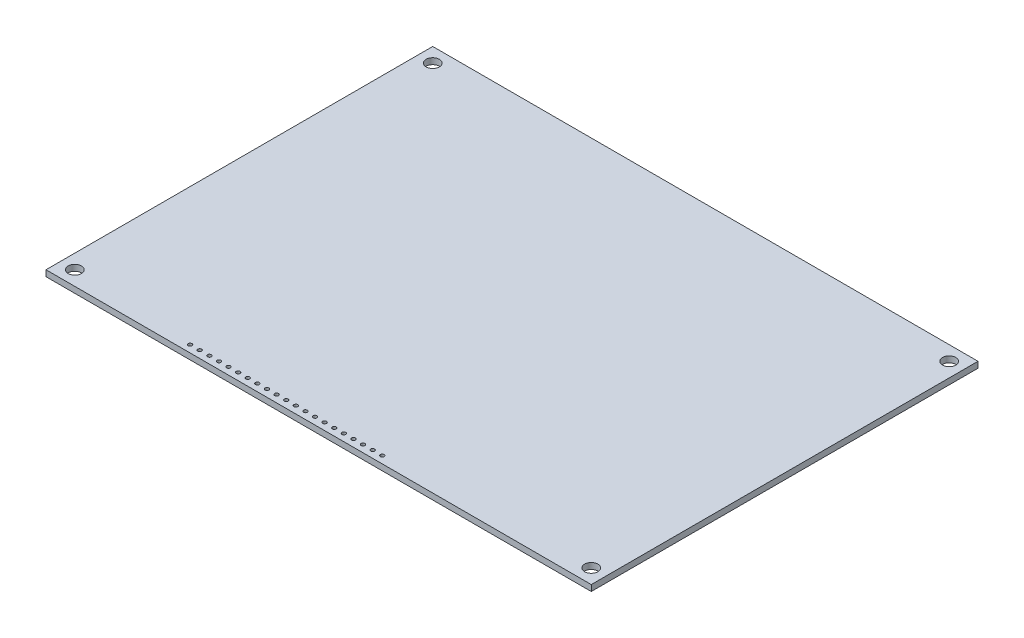
ISO-10303-21;
HEADER;
FILE_DESCRIPTION(('STEP AP214'),'2;1');
FILE_NAME('part.step','',(''),(''),'','','');
FILE_SCHEMA(('AUTOMOTIVE_DESIGN { 1 0 10303 214 1 1 1 1 }'));
ENDSEC;
DATA;
#1=APPLICATION_CONTEXT('core data for automotive mechanical design processes');
#2=APPLICATION_PROTOCOL_DEFINITION('international standard','automotive_design',2000,#1);
#3=PRODUCT_CONTEXT('',#1,'mechanical');
#4=PRODUCT('Part','Part','',(#3));
#5=PRODUCT_RELATED_PRODUCT_CATEGORY('part','',(#4));
#6=PRODUCT_DEFINITION_FORMATION('','',#4);
#7=PRODUCT_DEFINITION_CONTEXT('part definition',#1,'design');
#8=PRODUCT_DEFINITION('design','',#6,#7);
#9=PRODUCT_DEFINITION_SHAPE('','',#8);
#10=(LENGTH_UNIT() NAMED_UNIT(*) SI_UNIT(.MILLI.,.METRE.));
#11=(NAMED_UNIT(*) PLANE_ANGLE_UNIT() SI_UNIT($,.RADIAN.));
#12=(NAMED_UNIT(*) SI_UNIT($,.STERADIAN.) SOLID_ANGLE_UNIT());
#13=UNCERTAINTY_MEASURE_WITH_UNIT(LENGTH_MEASURE(1.E-05),#10,'distance_accuracy_value','');
#14=(GEOMETRIC_REPRESENTATION_CONTEXT(3) GLOBAL_UNCERTAINTY_ASSIGNED_CONTEXT((#13)) GLOBAL_UNIT_ASSIGNED_CONTEXT((#10,
#11,#12)) REPRESENTATION_CONTEXT('',''));
#15=CARTESIAN_POINT('',(0.,0.,0.));
#16=DIRECTION('',(0.,0.,1.));
#17=DIRECTION('',(1.,0.,0.));
#18=AXIS2_PLACEMENT_3D('',#15,#16,#17);
#19=CARTESIAN_POINT('',(0.,1.6,0.));
#20=DIRECTION('',(0.,-1.,0.));
#21=DIRECTION('',(0.,0.,-1.));
#22=AXIS2_PLACEMENT_3D('',#19,#20,#21);
#23=PLANE('',#22);
#24=CARTESIAN_POINT('',(36.2,1.6,-1.9));
#25=DIRECTION('',(0.,1.,0.));
#26=DIRECTION('',(0.,0.,1.));
#27=AXIS2_PLACEMENT_3D('',#24,#25,#26);
#28=CIRCLE('',#27,0.499999999999999);
#29=CARTESIAN_POINT('',(36.2,1.6,-1.4));
#30=VERTEX_POINT('',#29);
#31=EDGE_CURVE('E326',#30,#30,#28,.T.);
#32=ORIENTED_EDGE('',*,*,#31,.F.);
#33=EDGE_LOOP('',(#32));
#34=FACE_BOUND('',#33,.T.);
#35=CARTESIAN_POINT('',(38.74,1.6,-1.9));
#36=DIRECTION('',(0.,1.,0.));
#37=DIRECTION('',(0.,0.,1.));
#38=AXIS2_PLACEMENT_3D('',#35,#36,#37);
#39=CIRCLE('',#38,0.499999999999999);
#40=CARTESIAN_POINT('',(38.74,1.6,-1.4));
#41=VERTEX_POINT('',#40);
#42=EDGE_CURVE('E322',#41,#41,#39,.T.);
#43=ORIENTED_EDGE('',*,*,#42,.F.);
#44=EDGE_LOOP('',(#43));
#45=FACE_BOUND('',#44,.T.);
#46=CARTESIAN_POINT('',(41.28,1.6,-1.9));
#47=DIRECTION('',(0.,1.,0.));
#48=DIRECTION('',(0.,0.,1.));
#49=AXIS2_PLACEMENT_3D('',#46,#47,#48);
#50=CIRCLE('',#49,0.499999999999999);
#51=CARTESIAN_POINT('',(41.28,1.6,-1.4));
#52=VERTEX_POINT('',#51);
#53=EDGE_CURVE('E314',#52,#52,#50,.T.);
#54=ORIENTED_EDGE('',*,*,#53,.F.);
#55=EDGE_LOOP('',(#54));
#56=FACE_BOUND('',#55,.T.);
#57=CARTESIAN_POINT('',(43.82,1.6,-1.9));
#58=DIRECTION('',(0.,1.,0.));
#59=DIRECTION('',(0.,0.,1.));
#60=AXIS2_PLACEMENT_3D('',#57,#58,#59);
#61=CIRCLE('',#60,0.499999999999999);
#62=CARTESIAN_POINT('',(43.82,1.6,-1.4));
#63=VERTEX_POINT('',#62);
#64=EDGE_CURVE('E306',#63,#63,#61,.T.);
#65=ORIENTED_EDGE('',*,*,#64,.F.);
#66=EDGE_LOOP('',(#65));
#67=FACE_BOUND('',#66,.T.);
#68=CARTESIAN_POINT('',(46.36,1.6,-1.9));
#69=DIRECTION('',(0.,1.,0.));
#70=DIRECTION('',(0.,0.,1.));
#71=AXIS2_PLACEMENT_3D('',#68,#69,#70);
#72=CIRCLE('',#71,0.499999999999999);
#73=CARTESIAN_POINT('',(46.36,1.6,-1.4));
#74=VERTEX_POINT('',#73);
#75=EDGE_CURVE('E298',#74,#74,#72,.T.);
#76=ORIENTED_EDGE('',*,*,#75,.F.);
#77=EDGE_LOOP('',(#76));
#78=FACE_BOUND('',#77,.T.);
#79=CARTESIAN_POINT('',(48.9,1.6,-1.9));
#80=DIRECTION('',(0.,1.,0.));
#81=DIRECTION('',(0.,0.,1.));
#82=AXIS2_PLACEMENT_3D('',#79,#80,#81);
#83=CIRCLE('',#82,0.499999999999999);
#84=CARTESIAN_POINT('',(48.9,1.6,-1.4));
#85=VERTEX_POINT('',#84);
#86=EDGE_CURVE('E290',#85,#85,#83,.T.);
#87=ORIENTED_EDGE('',*,*,#86,.F.);
#88=EDGE_LOOP('',(#87));
#89=FACE_BOUND('',#88,.T.);
#90=CARTESIAN_POINT('',(51.44,1.6,-1.9));
#91=DIRECTION('',(0.,1.,0.));
#92=DIRECTION('',(0.,0.,1.));
#93=AXIS2_PLACEMENT_3D('',#90,#91,#92);
#94=CIRCLE('',#93,0.499999999999999);
#95=CARTESIAN_POINT('',(51.44,1.6,-1.4));
#96=VERTEX_POINT('',#95);
#97=EDGE_CURVE('E282',#96,#96,#94,.T.);
#98=ORIENTED_EDGE('',*,*,#97,.F.);
#99=EDGE_LOOP('',(#98));
#100=FACE_BOUND('',#99,.T.);
#101=CARTESIAN_POINT('',(53.98,1.6,-1.9));
#102=DIRECTION('',(0.,1.,0.));
#103=DIRECTION('',(0.,0.,1.));
#104=AXIS2_PLACEMENT_3D('',#101,#102,#103);
#105=CIRCLE('',#104,0.499999999999999);
#106=CARTESIAN_POINT('',(53.98,1.6,-1.4));
#107=VERTEX_POINT('',#106);
#108=EDGE_CURVE('E274',#107,#107,#105,.T.);
#109=ORIENTED_EDGE('',*,*,#108,.F.);
#110=EDGE_LOOP('',(#109));
#111=FACE_BOUND('',#110,.T.);
#112=CARTESIAN_POINT('',(56.52,1.6,-1.9));
#113=DIRECTION('',(0.,1.,0.));
#114=DIRECTION('',(0.,0.,1.));
#115=AXIS2_PLACEMENT_3D('',#112,#113,#114);
#116=CIRCLE('',#115,0.499999999999999);
#117=CARTESIAN_POINT('',(56.52,1.6,-1.4));
#118=VERTEX_POINT('',#117);
#119=EDGE_CURVE('E266',#118,#118,#116,.T.);
#120=ORIENTED_EDGE('',*,*,#119,.F.);
#121=EDGE_LOOP('',(#120));
#122=FACE_BOUND('',#121,.T.);
#123=CARTESIAN_POINT('',(59.06,1.6,-1.9));
#124=DIRECTION('',(0.,1.,0.));
#125=DIRECTION('',(0.,0.,1.));
#126=AXIS2_PLACEMENT_3D('',#123,#124,#125);
#127=CIRCLE('',#126,0.499999999999999);
#128=CARTESIAN_POINT('',(59.06,1.6,-1.4));
#129=VERTEX_POINT('',#128);
#130=EDGE_CURVE('E258',#129,#129,#127,.T.);
#131=ORIENTED_EDGE('',*,*,#130,.F.);
#132=EDGE_LOOP('',(#131));
#133=FACE_BOUND('',#132,.T.);
#134=CARTESIAN_POINT('',(61.6,1.6,-1.9));
#135=DIRECTION('',(0.,1.,0.));
#136=DIRECTION('',(0.,0.,1.));
#137=AXIS2_PLACEMENT_3D('',#134,#135,#136);
#138=CIRCLE('',#137,0.499999999999999);
#139=CARTESIAN_POINT('',(61.6,1.6,-1.4));
#140=VERTEX_POINT('',#139);
#141=EDGE_CURVE('E250',#140,#140,#138,.T.);
#142=ORIENTED_EDGE('',*,*,#141,.F.);
#143=EDGE_LOOP('',(#142));
#144=FACE_BOUND('',#143,.T.);
#145=CARTESIAN_POINT('',(64.14,1.6,-1.9));
#146=DIRECTION('',(0.,1.,0.));
#147=DIRECTION('',(0.,0.,1.));
#148=AXIS2_PLACEMENT_3D('',#145,#146,#147);
#149=CIRCLE('',#148,0.499999999999999);
#150=CARTESIAN_POINT('',(64.14,1.6,-1.4));
#151=VERTEX_POINT('',#150);
#152=EDGE_CURVE('E242',#151,#151,#149,.T.);
#153=ORIENTED_EDGE('',*,*,#152,.F.);
#154=EDGE_LOOP('',(#153));
#155=FACE_BOUND('',#154,.T.);
#156=CARTESIAN_POINT('',(66.68,1.6,-1.9));
#157=DIRECTION('',(0.,1.,0.));
#158=DIRECTION('',(0.,0.,1.));
#159=AXIS2_PLACEMENT_3D('',#156,#157,#158);
#160=CIRCLE('',#159,0.499999999999999);
#161=CARTESIAN_POINT('',(66.68,1.6,-1.4));
#162=VERTEX_POINT('',#161);
#163=EDGE_CURVE('E234',#162,#162,#160,.T.);
#164=ORIENTED_EDGE('',*,*,#163,.F.);
#165=EDGE_LOOP('',(#164));
#166=FACE_BOUND('',#165,.T.);
#167=CARTESIAN_POINT('',(69.22,1.6,-1.9));
#168=DIRECTION('',(0.,1.,0.));
#169=DIRECTION('',(0.,0.,1.));
#170=AXIS2_PLACEMENT_3D('',#167,#168,#169);
#171=CIRCLE('',#170,0.499999999999999);
#172=CARTESIAN_POINT('',(69.22,1.6,-1.4));
#173=VERTEX_POINT('',#172);
#174=EDGE_CURVE('E226',#173,#173,#171,.T.);
#175=ORIENTED_EDGE('',*,*,#174,.F.);
#176=EDGE_LOOP('',(#175));
#177=FACE_BOUND('',#176,.T.);
#178=CARTESIAN_POINT('',(71.76,1.6,-1.9));
#179=DIRECTION('',(0.,1.,0.));
#180=DIRECTION('',(0.,0.,1.));
#181=AXIS2_PLACEMENT_3D('',#178,#179,#180);
#182=CIRCLE('',#181,0.499999999999999);
#183=CARTESIAN_POINT('',(71.76,1.6,-1.4));
#184=VERTEX_POINT('',#183);
#185=EDGE_CURVE('E218',#184,#184,#182,.T.);
#186=ORIENTED_EDGE('',*,*,#185,.F.);
#187=EDGE_LOOP('',(#186));
#188=FACE_BOUND('',#187,.T.);
#189=CARTESIAN_POINT('',(74.3,1.6,-1.9));
#190=DIRECTION('',(0.,1.,0.));
#191=DIRECTION('',(0.,0.,1.));
#192=AXIS2_PLACEMENT_3D('',#189,#190,#191);
#193=CIRCLE('',#192,0.499999999999999);
#194=CARTESIAN_POINT('',(74.3,1.6,-1.4));
#195=VERTEX_POINT('',#194);
#196=EDGE_CURVE('E210',#195,#195,#193,.T.);
#197=ORIENTED_EDGE('',*,*,#196,.F.);
#198=EDGE_LOOP('',(#197));
#199=FACE_BOUND('',#198,.T.);
#200=CARTESIAN_POINT('',(76.84,1.6,-1.9));
#201=DIRECTION('',(0.,1.,0.));
#202=DIRECTION('',(0.,0.,1.));
#203=AXIS2_PLACEMENT_3D('',#200,#201,#202);
#204=CIRCLE('',#203,0.499999999999999);
#205=CARTESIAN_POINT('',(76.84,1.6,-1.4));
#206=VERTEX_POINT('',#205);
#207=EDGE_CURVE('E202',#206,#206,#204,.T.);
#208=ORIENTED_EDGE('',*,*,#207,.F.);
#209=EDGE_LOOP('',(#208));
#210=FACE_BOUND('',#209,.T.);
#211=CARTESIAN_POINT('',(79.38,1.6,-1.9));
#212=DIRECTION('',(0.,1.,0.));
#213=DIRECTION('',(0.,0.,1.));
#214=AXIS2_PLACEMENT_3D('',#211,#212,#213);
#215=CIRCLE('',#214,0.499999999999999);
#216=CARTESIAN_POINT('',(79.38,1.6,-1.4));
#217=VERTEX_POINT('',#216);
#218=EDGE_CURVE('E194',#217,#217,#215,.T.);
#219=ORIENTED_EDGE('',*,*,#218,.F.);
#220=EDGE_LOOP('',(#219));
#221=FACE_BOUND('',#220,.T.);
#222=CARTESIAN_POINT('',(81.92,1.6,-1.9));
#223=DIRECTION('',(0.,1.,0.));
#224=DIRECTION('',(0.,0.,1.));
#225=AXIS2_PLACEMENT_3D('',#222,#223,#224);
#226=CIRCLE('',#225,0.499999999999999);
#227=CARTESIAN_POINT('',(81.92,1.6,-1.4));
#228=VERTEX_POINT('',#227);
#229=EDGE_CURVE('E186',#228,#228,#226,.T.);
#230=ORIENTED_EDGE('',*,*,#229,.F.);
#231=EDGE_LOOP('',(#230));
#232=FACE_BOUND('',#231,.T.);
#233=CARTESIAN_POINT('',(84.46,1.6,-1.9));
#234=DIRECTION('',(0.,1.,0.));
#235=DIRECTION('',(0.,0.,1.));
#236=AXIS2_PLACEMENT_3D('',#233,#234,#235);
#237=CIRCLE('',#236,0.499999999999999);
#238=CARTESIAN_POINT('',(84.46,1.6,-1.4));
#239=VERTEX_POINT('',#238);
#240=EDGE_CURVE('E178',#239,#239,#237,.T.);
#241=ORIENTED_EDGE('',*,*,#240,.F.);
#242=EDGE_LOOP('',(#241));
#243=FACE_BOUND('',#242,.T.);
#244=CARTESIAN_POINT('',(87.,1.6,-1.9));
#245=DIRECTION('',(0.,1.,0.));
#246=DIRECTION('',(0.,0.,1.));
#247=AXIS2_PLACEMENT_3D('',#244,#245,#246);
#248=CIRCLE('',#247,0.499999999999999);
#249=CARTESIAN_POINT('',(87.,1.6,-1.4));
#250=VERTEX_POINT('',#249);
#251=EDGE_CURVE('E170',#250,#250,#248,.T.);
#252=ORIENTED_EDGE('',*,*,#251,.F.);
#253=EDGE_LOOP('',(#252));
#254=FACE_BOUND('',#253,.T.);
#255=DIRECTION('',(0.,0.,1.));
#256=VECTOR('',#255,1.);
#257=CARTESIAN_POINT('',(0.,1.6,0.));
#258=LINE('',#257,#256);
#259=CARTESIAN_POINT('',(0.,1.6,-102.235));
#260=VERTEX_POINT('',#259);
#261=CARTESIAN_POINT('',(0.,1.6,0.));
#262=VERTEX_POINT('',#261);
#263=EDGE_CURVE('E96',#260,#262,#258,.T.);
#264=ORIENTED_EDGE('',*,*,#263,.T.);
#265=DIRECTION('',(1.,0.,0.));
#266=VECTOR('',#265,1.);
#267=CARTESIAN_POINT('',(0.,1.6,0.));
#268=LINE('',#267,#266);
#269=CARTESIAN_POINT('',(144.145,1.6,0.));
#270=VERTEX_POINT('',#269);
#271=EDGE_CURVE('E91',#262,#270,#268,.T.);
#272=ORIENTED_EDGE('',*,*,#271,.T.);
#273=DIRECTION('',(0.,0.,-1.));
#274=VECTOR('',#273,1.);
#275=CARTESIAN_POINT('',(144.145,1.6,0.));
#276=LINE('',#275,#274);
#277=CARTESIAN_POINT('',(144.145,1.6,-102.235));
#278=VERTEX_POINT('',#277);
#279=EDGE_CURVE('E94',#270,#278,#276,.T.);
#280=ORIENTED_EDGE('',*,*,#279,.T.);
#281=DIRECTION('',(-1.,0.,0.));
#282=VECTOR('',#281,1.);
#283=CARTESIAN_POINT('',(0.,1.6,-102.235));
#284=LINE('',#283,#282);
#285=EDGE_CURVE('E61',#278,#260,#284,.T.);
#286=ORIENTED_EDGE('',*,*,#285,.T.);
#287=EDGE_LOOP('',(#264,#272,#280,#286));
#288=FACE_BOUND('',#287,.T.);
#289=CARTESIAN_POINT('',(3.815,1.6,-98.42));
#290=DIRECTION('',(0.,1.,0.));
#291=DIRECTION('',(0.,0.,1.));
#292=AXIS2_PLACEMENT_3D('',#289,#290,#291);
#293=CIRCLE('',#292,1.7526);
#294=CARTESIAN_POINT('',(3.815,1.6,-96.6674));
#295=VERTEX_POINT('',#294);
#296=EDGE_CURVE('E116',#295,#295,#293,.T.);
#297=ORIENTED_EDGE('',*,*,#296,.F.);
#298=EDGE_LOOP('',(#297));
#299=FACE_BOUND('',#298,.T.);
#300=CARTESIAN_POINT('',(140.33,1.6,-98.42));
#301=DIRECTION('',(0.,1.,0.));
#302=DIRECTION('',(0.,0.,1.));
#303=AXIS2_PLACEMENT_3D('',#300,#301,#302);
#304=CIRCLE('',#303,1.7526);
#305=CARTESIAN_POINT('',(140.33,1.6,-96.6674));
#306=VERTEX_POINT('',#305);
#307=EDGE_CURVE('E138',#306,#306,#304,.T.);
#308=ORIENTED_EDGE('',*,*,#307,.F.);
#309=EDGE_LOOP('',(#308));
#310=FACE_BOUND('',#309,.T.);
#311=CARTESIAN_POINT('',(140.33,1.6,-3.815));
#312=DIRECTION('',(0.,1.,0.));
#313=DIRECTION('',(0.,0.,1.));
#314=AXIS2_PLACEMENT_3D('',#311,#312,#313);
#315=CIRCLE('',#314,1.7526);
#316=CARTESIAN_POINT('',(140.33,1.6,-2.0624));
#317=VERTEX_POINT('',#316);
#318=EDGE_CURVE('E146',#317,#317,#315,.T.);
#319=ORIENTED_EDGE('',*,*,#318,.F.);
#320=EDGE_LOOP('',(#319));
#321=FACE_BOUND('',#320,.T.);
#322=CARTESIAN_POINT('',(3.815,1.6,-3.815));
#323=DIRECTION('',(0.,1.,0.));
#324=DIRECTION('',(0.,0.,1.));
#325=AXIS2_PLACEMENT_3D('',#322,#323,#324);
#326=CIRCLE('',#325,1.7526);
#327=CARTESIAN_POINT('',(3.815,1.6,-2.0624));
#328=VERTEX_POINT('',#327);
#329=EDGE_CURVE('E154',#328,#328,#326,.T.);
#330=ORIENTED_EDGE('',*,*,#329,.F.);
#331=EDGE_LOOP('',(#330));
#332=FACE_BOUND('',#331,.T.);
#333=ADVANCED_FACE('F43',(#34,#45,#56,#67,#78,#89,#100,#111,#122,#133,#144,#155,#166,#177,#188,
#199,#210,#221,#232,#243,#254,#288,#299,#310,#321,#332),#23,.F.);
#334=CARTESIAN_POINT('',(0.,0.,0.));
#335=DIRECTION('',(0.,-1.,0.));
#336=DIRECTION('',(0.,0.,-1.));
#337=AXIS2_PLACEMENT_3D('',#334,#335,#336);
#338=PLANE('',#337);
#339=CARTESIAN_POINT('',(36.2,0.,-1.9));
#340=DIRECTION('',(0.,1.,0.));
#341=DIRECTION('',(0.,0.,1.));
#342=AXIS2_PLACEMENT_3D('',#339,#340,#341);
#343=CIRCLE('',#342,0.499999999999999);
#344=CARTESIAN_POINT('',(36.2,0.,-1.4));
#345=VERTEX_POINT('',#344);
#346=EDGE_CURVE('E162',#345,#345,#343,.T.);
#347=ORIENTED_EDGE('',*,*,#346,.T.);
#348=EDGE_LOOP('',(#347));
#349=FACE_BOUND('',#348,.T.);
#350=CARTESIAN_POINT('',(38.74,0.,-1.9));
#351=DIRECTION('',(0.,1.,0.));
#352=DIRECTION('',(0.,0.,1.));
#353=AXIS2_PLACEMENT_3D('',#350,#351,#352);
#354=CIRCLE('',#353,0.499999999999999);
#355=CARTESIAN_POINT('',(38.74,0.,-1.4));
#356=VERTEX_POINT('',#355);
#357=EDGE_CURVE('E318',#356,#356,#354,.T.);
#358=ORIENTED_EDGE('',*,*,#357,.T.);
#359=EDGE_LOOP('',(#358));
#360=FACE_BOUND('',#359,.T.);
#361=CARTESIAN_POINT('',(41.28,0.,-1.9));
#362=DIRECTION('',(0.,1.,0.));
#363=DIRECTION('',(0.,0.,1.));
#364=AXIS2_PLACEMENT_3D('',#361,#362,#363);
#365=CIRCLE('',#364,0.499999999999999);
#366=CARTESIAN_POINT('',(41.28,0.,-1.4));
#367=VERTEX_POINT('',#366);
#368=EDGE_CURVE('E310',#367,#367,#365,.T.);
#369=ORIENTED_EDGE('',*,*,#368,.T.);
#370=EDGE_LOOP('',(#369));
#371=FACE_BOUND('',#370,.T.);
#372=CARTESIAN_POINT('',(43.82,0.,-1.9));
#373=DIRECTION('',(0.,1.,0.));
#374=DIRECTION('',(0.,0.,1.));
#375=AXIS2_PLACEMENT_3D('',#372,#373,#374);
#376=CIRCLE('',#375,0.499999999999999);
#377=CARTESIAN_POINT('',(43.82,0.,-1.4));
#378=VERTEX_POINT('',#377);
#379=EDGE_CURVE('E302',#378,#378,#376,.T.);
#380=ORIENTED_EDGE('',*,*,#379,.T.);
#381=EDGE_LOOP('',(#380));
#382=FACE_BOUND('',#381,.T.);
#383=CARTESIAN_POINT('',(46.36,0.,-1.9));
#384=DIRECTION('',(0.,1.,0.));
#385=DIRECTION('',(0.,0.,1.));
#386=AXIS2_PLACEMENT_3D('',#383,#384,#385);
#387=CIRCLE('',#386,0.499999999999999);
#388=CARTESIAN_POINT('',(46.36,0.,-1.4));
#389=VERTEX_POINT('',#388);
#390=EDGE_CURVE('E294',#389,#389,#387,.T.);
#391=ORIENTED_EDGE('',*,*,#390,.T.);
#392=EDGE_LOOP('',(#391));
#393=FACE_BOUND('',#392,.T.);
#394=CARTESIAN_POINT('',(48.9,0.,-1.9));
#395=DIRECTION('',(0.,1.,0.));
#396=DIRECTION('',(0.,0.,1.));
#397=AXIS2_PLACEMENT_3D('',#394,#395,#396);
#398=CIRCLE('',#397,0.499999999999999);
#399=CARTESIAN_POINT('',(48.9,0.,-1.4));
#400=VERTEX_POINT('',#399);
#401=EDGE_CURVE('E286',#400,#400,#398,.T.);
#402=ORIENTED_EDGE('',*,*,#401,.T.);
#403=EDGE_LOOP('',(#402));
#404=FACE_BOUND('',#403,.T.);
#405=CARTESIAN_POINT('',(51.44,0.,-1.9));
#406=DIRECTION('',(0.,1.,0.));
#407=DIRECTION('',(0.,0.,1.));
#408=AXIS2_PLACEMENT_3D('',#405,#406,#407);
#409=CIRCLE('',#408,0.499999999999999);
#410=CARTESIAN_POINT('',(51.44,0.,-1.4));
#411=VERTEX_POINT('',#410);
#412=EDGE_CURVE('E278',#411,#411,#409,.T.);
#413=ORIENTED_EDGE('',*,*,#412,.T.);
#414=EDGE_LOOP('',(#413));
#415=FACE_BOUND('',#414,.T.);
#416=CARTESIAN_POINT('',(53.98,0.,-1.9));
#417=DIRECTION('',(0.,1.,0.));
#418=DIRECTION('',(0.,0.,1.));
#419=AXIS2_PLACEMENT_3D('',#416,#417,#418);
#420=CIRCLE('',#419,0.499999999999999);
#421=CARTESIAN_POINT('',(53.98,0.,-1.4));
#422=VERTEX_POINT('',#421);
#423=EDGE_CURVE('E270',#422,#422,#420,.T.);
#424=ORIENTED_EDGE('',*,*,#423,.T.);
#425=EDGE_LOOP('',(#424));
#426=FACE_BOUND('',#425,.T.);
#427=CARTESIAN_POINT('',(56.52,0.,-1.9));
#428=DIRECTION('',(0.,1.,0.));
#429=DIRECTION('',(0.,0.,1.));
#430=AXIS2_PLACEMENT_3D('',#427,#428,#429);
#431=CIRCLE('',#430,0.499999999999999);
#432=CARTESIAN_POINT('',(56.52,0.,-1.4));
#433=VERTEX_POINT('',#432);
#434=EDGE_CURVE('E262',#433,#433,#431,.T.);
#435=ORIENTED_EDGE('',*,*,#434,.T.);
#436=EDGE_LOOP('',(#435));
#437=FACE_BOUND('',#436,.T.);
#438=CARTESIAN_POINT('',(59.06,0.,-1.9));
#439=DIRECTION('',(0.,1.,0.));
#440=DIRECTION('',(0.,0.,1.));
#441=AXIS2_PLACEMENT_3D('',#438,#439,#440);
#442=CIRCLE('',#441,0.499999999999999);
#443=CARTESIAN_POINT('',(59.06,0.,-1.4));
#444=VERTEX_POINT('',#443);
#445=EDGE_CURVE('E254',#444,#444,#442,.T.);
#446=ORIENTED_EDGE('',*,*,#445,.T.);
#447=EDGE_LOOP('',(#446));
#448=FACE_BOUND('',#447,.T.);
#449=CARTESIAN_POINT('',(61.6,0.,-1.9));
#450=DIRECTION('',(0.,1.,0.));
#451=DIRECTION('',(0.,0.,1.));
#452=AXIS2_PLACEMENT_3D('',#449,#450,#451);
#453=CIRCLE('',#452,0.499999999999999);
#454=CARTESIAN_POINT('',(61.6,0.,-1.4));
#455=VERTEX_POINT('',#454);
#456=EDGE_CURVE('E246',#455,#455,#453,.T.);
#457=ORIENTED_EDGE('',*,*,#456,.T.);
#458=EDGE_LOOP('',(#457));
#459=FACE_BOUND('',#458,.T.);
#460=CARTESIAN_POINT('',(64.14,0.,-1.9));
#461=DIRECTION('',(0.,1.,0.));
#462=DIRECTION('',(0.,0.,1.));
#463=AXIS2_PLACEMENT_3D('',#460,#461,#462);
#464=CIRCLE('',#463,0.499999999999999);
#465=CARTESIAN_POINT('',(64.14,0.,-1.4));
#466=VERTEX_POINT('',#465);
#467=EDGE_CURVE('E238',#466,#466,#464,.T.);
#468=ORIENTED_EDGE('',*,*,#467,.T.);
#469=EDGE_LOOP('',(#468));
#470=FACE_BOUND('',#469,.T.);
#471=CARTESIAN_POINT('',(66.68,0.,-1.9));
#472=DIRECTION('',(0.,1.,0.));
#473=DIRECTION('',(0.,0.,1.));
#474=AXIS2_PLACEMENT_3D('',#471,#472,#473);
#475=CIRCLE('',#474,0.499999999999999);
#476=CARTESIAN_POINT('',(66.68,0.,-1.4));
#477=VERTEX_POINT('',#476);
#478=EDGE_CURVE('E230',#477,#477,#475,.T.);
#479=ORIENTED_EDGE('',*,*,#478,.T.);
#480=EDGE_LOOP('',(#479));
#481=FACE_BOUND('',#480,.T.);
#482=CARTESIAN_POINT('',(69.22,0.,-1.9));
#483=DIRECTION('',(0.,1.,0.));
#484=DIRECTION('',(0.,0.,1.));
#485=AXIS2_PLACEMENT_3D('',#482,#483,#484);
#486=CIRCLE('',#485,0.499999999999999);
#487=CARTESIAN_POINT('',(69.22,0.,-1.4));
#488=VERTEX_POINT('',#487);
#489=EDGE_CURVE('E222',#488,#488,#486,.T.);
#490=ORIENTED_EDGE('',*,*,#489,.T.);
#491=EDGE_LOOP('',(#490));
#492=FACE_BOUND('',#491,.T.);
#493=CARTESIAN_POINT('',(71.76,0.,-1.9));
#494=DIRECTION('',(0.,1.,0.));
#495=DIRECTION('',(0.,0.,1.));
#496=AXIS2_PLACEMENT_3D('',#493,#494,#495);
#497=CIRCLE('',#496,0.499999999999999);
#498=CARTESIAN_POINT('',(71.76,0.,-1.4));
#499=VERTEX_POINT('',#498);
#500=EDGE_CURVE('E214',#499,#499,#497,.T.);
#501=ORIENTED_EDGE('',*,*,#500,.T.);
#502=EDGE_LOOP('',(#501));
#503=FACE_BOUND('',#502,.T.);
#504=CARTESIAN_POINT('',(74.3,0.,-1.9));
#505=DIRECTION('',(0.,1.,0.));
#506=DIRECTION('',(0.,0.,1.));
#507=AXIS2_PLACEMENT_3D('',#504,#505,#506);
#508=CIRCLE('',#507,0.499999999999999);
#509=CARTESIAN_POINT('',(74.3,0.,-1.4));
#510=VERTEX_POINT('',#509);
#511=EDGE_CURVE('E206',#510,#510,#508,.T.);
#512=ORIENTED_EDGE('',*,*,#511,.T.);
#513=EDGE_LOOP('',(#512));
#514=FACE_BOUND('',#513,.T.);
#515=CARTESIAN_POINT('',(76.84,0.,-1.9));
#516=DIRECTION('',(0.,1.,0.));
#517=DIRECTION('',(0.,0.,1.));
#518=AXIS2_PLACEMENT_3D('',#515,#516,#517);
#519=CIRCLE('',#518,0.499999999999999);
#520=CARTESIAN_POINT('',(76.84,0.,-1.4));
#521=VERTEX_POINT('',#520);
#522=EDGE_CURVE('E198',#521,#521,#519,.T.);
#523=ORIENTED_EDGE('',*,*,#522,.T.);
#524=EDGE_LOOP('',(#523));
#525=FACE_BOUND('',#524,.T.);
#526=CARTESIAN_POINT('',(79.38,0.,-1.9));
#527=DIRECTION('',(0.,1.,0.));
#528=DIRECTION('',(0.,0.,1.));
#529=AXIS2_PLACEMENT_3D('',#526,#527,#528);
#530=CIRCLE('',#529,0.499999999999999);
#531=CARTESIAN_POINT('',(79.38,0.,-1.4));
#532=VERTEX_POINT('',#531);
#533=EDGE_CURVE('E190',#532,#532,#530,.T.);
#534=ORIENTED_EDGE('',*,*,#533,.T.);
#535=EDGE_LOOP('',(#534));
#536=FACE_BOUND('',#535,.T.);
#537=CARTESIAN_POINT('',(81.92,0.,-1.9));
#538=DIRECTION('',(0.,1.,0.));
#539=DIRECTION('',(0.,0.,1.));
#540=AXIS2_PLACEMENT_3D('',#537,#538,#539);
#541=CIRCLE('',#540,0.499999999999999);
#542=CARTESIAN_POINT('',(81.92,0.,-1.4));
#543=VERTEX_POINT('',#542);
#544=EDGE_CURVE('E182',#543,#543,#541,.T.);
#545=ORIENTED_EDGE('',*,*,#544,.T.);
#546=EDGE_LOOP('',(#545));
#547=FACE_BOUND('',#546,.T.);
#548=CARTESIAN_POINT('',(84.46,0.,-1.9));
#549=DIRECTION('',(0.,1.,0.));
#550=DIRECTION('',(0.,0.,1.));
#551=AXIS2_PLACEMENT_3D('',#548,#549,#550);
#552=CIRCLE('',#551,0.499999999999999);
#553=CARTESIAN_POINT('',(84.46,0.,-1.4));
#554=VERTEX_POINT('',#553);
#555=EDGE_CURVE('E174',#554,#554,#552,.T.);
#556=ORIENTED_EDGE('',*,*,#555,.T.);
#557=EDGE_LOOP('',(#556));
#558=FACE_BOUND('',#557,.T.);
#559=CARTESIAN_POINT('',(87.,0.,-1.9));
#560=DIRECTION('',(0.,1.,0.));
#561=DIRECTION('',(0.,0.,1.));
#562=AXIS2_PLACEMENT_3D('',#559,#560,#561);
#563=CIRCLE('',#562,0.499999999999999);
#564=CARTESIAN_POINT('',(87.,0.,-1.4));
#565=VERTEX_POINT('',#564);
#566=EDGE_CURVE('E166',#565,#565,#563,.T.);
#567=ORIENTED_EDGE('',*,*,#566,.T.);
#568=EDGE_LOOP('',(#567));
#569=FACE_BOUND('',#568,.T.);
#570=CARTESIAN_POINT('',(140.33,0.,-3.815));
#571=DIRECTION('',(0.,1.,0.));
#572=DIRECTION('',(0.,0.,1.));
#573=AXIS2_PLACEMENT_3D('',#570,#571,#572);
#574=CIRCLE('',#573,1.7526);
#575=CARTESIAN_POINT('',(140.33,0.,-2.0624));
#576=VERTEX_POINT('',#575);
#577=EDGE_CURVE('E150',#576,#576,#574,.T.);
#578=ORIENTED_EDGE('',*,*,#577,.T.);
#579=EDGE_LOOP('',(#578));
#580=FACE_BOUND('',#579,.T.);
#581=CARTESIAN_POINT('',(3.815,0.,-98.42));
#582=DIRECTION('',(0.,1.,0.));
#583=DIRECTION('',(0.,0.,1.));
#584=AXIS2_PLACEMENT_3D('',#581,#582,#583);
#585=CIRCLE('',#584,1.7526);
#586=CARTESIAN_POINT('',(3.815,0.,-96.6674));
#587=VERTEX_POINT('',#586);
#588=EDGE_CURVE('E134',#587,#587,#585,.T.);
#589=ORIENTED_EDGE('',*,*,#588,.T.);
#590=EDGE_LOOP('',(#589));
#591=FACE_BOUND('',#590,.T.);
#592=DIRECTION('',(0.,0.,1.));
#593=VECTOR('',#592,1.);
#594=CARTESIAN_POINT('',(0.,0.,0.));
#595=LINE('',#594,#593);
#596=CARTESIAN_POINT('',(0.,0.,-102.235));
#597=VERTEX_POINT('',#596);
#598=CARTESIAN_POINT('',(0.,0.,0.));
#599=VERTEX_POINT('',#598);
#600=EDGE_CURVE('E112',#597,#599,#595,.T.);
#601=ORIENTED_EDGE('',*,*,#600,.F.);
#602=DIRECTION('',(-1.,0.,0.));
#603=VECTOR('',#602,1.);
#604=CARTESIAN_POINT('',(0.,0.,-102.235));
#605=LINE('',#604,#603);
#606=CARTESIAN_POINT('',(144.145,0.,-102.235));
#607=VERTEX_POINT('',#606);
#608=EDGE_CURVE('E84',#607,#597,#605,.T.);
#609=ORIENTED_EDGE('',*,*,#608,.F.);
#610=DIRECTION('',(0.,0.,-1.));
#611=VECTOR('',#610,1.);
#612=CARTESIAN_POINT('',(144.145,0.,0.));
#613=LINE('',#612,#611);
#614=CARTESIAN_POINT('',(144.145,0.,0.));
#615=VERTEX_POINT('',#614);
#616=EDGE_CURVE('E78',#615,#607,#613,.T.);
#617=ORIENTED_EDGE('',*,*,#616,.F.);
#618=DIRECTION('',(1.,0.,0.));
#619=VECTOR('',#618,1.);
#620=CARTESIAN_POINT('',(0.,0.,0.));
#621=LINE('',#620,#619);
#622=EDGE_CURVE('E101',#599,#615,#621,.T.);
#623=ORIENTED_EDGE('',*,*,#622,.F.);
#624=EDGE_LOOP('',(#601,#609,#617,#623));
#625=FACE_BOUND('',#624,.T.);
#626=CARTESIAN_POINT('',(140.33,0.,-98.42));
#627=DIRECTION('',(0.,1.,0.));
#628=DIRECTION('',(0.,0.,1.));
#629=AXIS2_PLACEMENT_3D('',#626,#627,#628);
#630=CIRCLE('',#629,1.7526);
#631=CARTESIAN_POINT('',(140.33,0.,-96.6674));
#632=VERTEX_POINT('',#631);
#633=EDGE_CURVE('E142',#632,#632,#630,.T.);
#634=ORIENTED_EDGE('',*,*,#633,.T.);
#635=EDGE_LOOP('',(#634));
#636=FACE_BOUND('',#635,.T.);
#637=CARTESIAN_POINT('',(3.815,0.,-3.815));
#638=DIRECTION('',(0.,1.,0.));
#639=DIRECTION('',(0.,0.,1.));
#640=AXIS2_PLACEMENT_3D('',#637,#638,#639);
#641=CIRCLE('',#640,1.7526);
#642=CARTESIAN_POINT('',(3.815,0.,-2.0624));
#643=VERTEX_POINT('',#642);
#644=EDGE_CURVE('E158',#643,#643,#641,.T.);
#645=ORIENTED_EDGE('',*,*,#644,.T.);
#646=EDGE_LOOP('',(#645));
#647=FACE_BOUND('',#646,.T.);
#648=ADVANCED_FACE('F129',(#349,#360,#371,#382,#393,#404,#415,#426,#437,#448,#459,#470,#481,
#492,#503,#514,#525,#536,#547,#558,#569,#580,#591,#625,#636,#647),#338,.T.);
#649=CARTESIAN_POINT('',(0.,1.6,0.));
#650=DIRECTION('',(1.,0.,0.));
#651=DIRECTION('',(0.,0.,-1.));
#652=AXIS2_PLACEMENT_3D('',#649,#650,#651);
#653=PLANE('',#652);
#654=ORIENTED_EDGE('',*,*,#600,.T.);
#655=DIRECTION('',(0.,-1.,0.));
#656=VECTOR('',#655,1.);
#657=CARTESIAN_POINT('',(0.,1.6,0.));
#658=LINE('',#657,#656);
#659=EDGE_CURVE('E11',#262,#599,#658,.T.);
#660=ORIENTED_EDGE('',*,*,#659,.F.);
#661=ORIENTED_EDGE('',*,*,#263,.F.);
#662=DIRECTION('',(0.,-1.,0.));
#663=VECTOR('',#662,1.);
#664=CARTESIAN_POINT('',(0.,1.6,-102.235));
#665=LINE('',#664,#663);
#666=EDGE_CURVE('E108',#260,#597,#665,.T.);
#667=ORIENTED_EDGE('',*,*,#666,.T.);
#668=EDGE_LOOP('',(#654,#660,#661,#667));
#669=FACE_BOUND('',#668,.T.);
#670=ADVANCED_FACE('F45',(#669),#653,.F.);
#671=CARTESIAN_POINT('',(0.,1.6,0.));
#672=DIRECTION('',(0.,0.,-1.));
#673=DIRECTION('',(-1.,0.,0.));
#674=AXIS2_PLACEMENT_3D('',#671,#672,#673);
#675=PLANE('',#674);
#676=ORIENTED_EDGE('',*,*,#622,.T.);
#677=DIRECTION('',(0.,-1.,0.));
#678=VECTOR('',#677,1.);
#679=CARTESIAN_POINT('',(144.145,1.6,0.));
#680=LINE('',#679,#678);
#681=EDGE_CURVE('E53',#270,#615,#680,.T.);
#682=ORIENTED_EDGE('',*,*,#681,.F.);
#683=ORIENTED_EDGE('',*,*,#271,.F.);
#684=ORIENTED_EDGE('',*,*,#659,.T.);
#685=EDGE_LOOP('',(#676,#682,#683,#684));
#686=FACE_BOUND('',#685,.T.);
#687=ADVANCED_FACE('F100',(#686),#675,.F.);
#688=CARTESIAN_POINT('',(144.145,1.6,0.));
#689=DIRECTION('',(-1.,0.,0.));
#690=DIRECTION('',(0.,0.,1.));
#691=AXIS2_PLACEMENT_3D('',#688,#689,#690);
#692=PLANE('',#691);
#693=ORIENTED_EDGE('',*,*,#616,.T.);
#694=DIRECTION('',(0.,-1.,0.));
#695=VECTOR('',#694,1.);
#696=CARTESIAN_POINT('',(144.145,1.6,-102.235));
#697=LINE('',#696,#695);
#698=EDGE_CURVE('E103',#278,#607,#697,.T.);
#699=ORIENTED_EDGE('',*,*,#698,.F.);
#700=ORIENTED_EDGE('',*,*,#279,.F.);
#701=ORIENTED_EDGE('',*,*,#681,.T.);
#702=EDGE_LOOP('',(#693,#699,#700,#701));
#703=FACE_BOUND('',#702,.T.);
#704=ADVANCED_FACE('F104',(#703),#692,.F.);
#705=CARTESIAN_POINT('',(0.,1.6,-102.235));
#706=DIRECTION('',(0.,0.,1.));
#707=DIRECTION('',(1.,0.,0.));
#708=AXIS2_PLACEMENT_3D('',#705,#706,#707);
#709=PLANE('',#708);
#710=ORIENTED_EDGE('',*,*,#608,.T.);
#711=ORIENTED_EDGE('',*,*,#666,.F.);
#712=ORIENTED_EDGE('',*,*,#285,.F.);
#713=ORIENTED_EDGE('',*,*,#698,.T.);
#714=EDGE_LOOP('',(#710,#711,#712,#713));
#715=FACE_BOUND('',#714,.T.);
#716=ADVANCED_FACE('F126',(#715),#709,.F.);
#717=CARTESIAN_POINT('',(3.815,1.6,-98.42));
#718=DIRECTION('',(0.,-1.,0.));
#719=DIRECTION('',(0.,0.,-1.));
#720=AXIS2_PLACEMENT_3D('',#717,#718,#719);
#721=CYLINDRICAL_SURFACE('',#720,1.7526);
#722=ORIENTED_EDGE('',*,*,#296,.T.);
#723=EDGE_LOOP('',(#722));
#724=FACE_BOUND('',#723,.T.);
#725=ORIENTED_EDGE('',*,*,#588,.F.);
#726=EDGE_LOOP('',(#725));
#727=FACE_BOUND('',#726,.T.);
#728=ADVANCED_FACE('F411',(#724,#727),#721,.F.);
#729=CARTESIAN_POINT('',(140.33,1.6,-98.42));
#730=DIRECTION('',(0.,-1.,0.));
#731=DIRECTION('',(0.,0.,-1.));
#732=AXIS2_PLACEMENT_3D('',#729,#730,#731);
#733=CYLINDRICAL_SURFACE('',#732,1.7526);
#734=ORIENTED_EDGE('',*,*,#307,.T.);
#735=EDGE_LOOP('',(#734));
#736=FACE_BOUND('',#735,.T.);
#737=ORIENTED_EDGE('',*,*,#633,.F.);
#738=EDGE_LOOP('',(#737));
#739=FACE_BOUND('',#738,.T.);
#740=ADVANCED_FACE('F407',(#736,#739),#733,.F.);
#741=CARTESIAN_POINT('',(140.33,1.6,-3.815));
#742=DIRECTION('',(0.,-1.,0.));
#743=DIRECTION('',(0.,0.,-1.));
#744=AXIS2_PLACEMENT_3D('',#741,#742,#743);
#745=CYLINDRICAL_SURFACE('',#744,1.7526);
#746=ORIENTED_EDGE('',*,*,#318,.T.);
#747=EDGE_LOOP('',(#746));
#748=FACE_BOUND('',#747,.T.);
#749=ORIENTED_EDGE('',*,*,#577,.F.);
#750=EDGE_LOOP('',(#749));
#751=FACE_BOUND('',#750,.T.);
#752=ADVANCED_FACE('F399',(#748,#751),#745,.F.);
#753=CARTESIAN_POINT('',(3.815,1.6,-3.815));
#754=DIRECTION('',(0.,-1.,0.));
#755=DIRECTION('',(0.,0.,-1.));
#756=AXIS2_PLACEMENT_3D('',#753,#754,#755);
#757=CYLINDRICAL_SURFACE('',#756,1.7526);
#758=ORIENTED_EDGE('',*,*,#329,.T.);
#759=EDGE_LOOP('',(#758));
#760=FACE_BOUND('',#759,.T.);
#761=ORIENTED_EDGE('',*,*,#644,.F.);
#762=EDGE_LOOP('',(#761));
#763=FACE_BOUND('',#762,.T.);
#764=ADVANCED_FACE('F389',(#760,#763),#757,.F.);
#765=CARTESIAN_POINT('',(87.,0.,-1.9));
#766=DIRECTION('',(0.,1.,0.));
#767=DIRECTION('',(0.,0.,1.));
#768=AXIS2_PLACEMENT_3D('',#765,#766,#767);
#769=CYLINDRICAL_SURFACE('',#768,0.499999999999999);
#770=ORIENTED_EDGE('',*,*,#566,.F.);
#771=EDGE_LOOP('',(#770));
#772=FACE_BOUND('',#771,.T.);
#773=ORIENTED_EDGE('',*,*,#251,.T.);
#774=EDGE_LOOP('',(#773));
#775=FACE_BOUND('',#774,.T.);
#776=ADVANCED_FACE('F386',(#772,#775),#769,.F.);
#777=CARTESIAN_POINT('',(84.46,0.,-1.9));
#778=DIRECTION('',(0.,1.,0.));
#779=DIRECTION('',(0.,0.,1.));
#780=AXIS2_PLACEMENT_3D('',#777,#778,#779);
#781=CYLINDRICAL_SURFACE('',#780,0.499999999999999);
#782=ORIENTED_EDGE('',*,*,#555,.F.);
#783=EDGE_LOOP('',(#782));
#784=FACE_BOUND('',#783,.T.);
#785=ORIENTED_EDGE('',*,*,#240,.T.);
#786=EDGE_LOOP('',(#785));
#787=FACE_BOUND('',#786,.T.);
#788=ADVANCED_FACE('F388',(#784,#787),#781,.F.);
#789=CARTESIAN_POINT('',(81.92,0.,-1.9));
#790=DIRECTION('',(0.,1.,0.));
#791=DIRECTION('',(0.,0.,1.));
#792=AXIS2_PLACEMENT_3D('',#789,#790,#791);
#793=CYLINDRICAL_SURFACE('',#792,0.499999999999999);
#794=ORIENTED_EDGE('',*,*,#544,.F.);
#795=EDGE_LOOP('',(#794));
#796=FACE_BOUND('',#795,.T.);
#797=ORIENTED_EDGE('',*,*,#229,.T.);
#798=EDGE_LOOP('',(#797));
#799=FACE_BOUND('',#798,.T.);
#800=ADVANCED_FACE('F396',(#796,#799),#793,.F.);
#801=CARTESIAN_POINT('',(79.38,0.,-1.9));
#802=DIRECTION('',(0.,1.,0.));
#803=DIRECTION('',(0.,0.,1.));
#804=AXIS2_PLACEMENT_3D('',#801,#802,#803);
#805=CYLINDRICAL_SURFACE('',#804,0.499999999999999);
#806=ORIENTED_EDGE('',*,*,#533,.F.);
#807=EDGE_LOOP('',(#806));
#808=FACE_BOUND('',#807,.T.);
#809=ORIENTED_EDGE('',*,*,#218,.T.);
#810=EDGE_LOOP('',(#809));
#811=FACE_BOUND('',#810,.T.);
#812=ADVANCED_FACE('F519',(#808,#811),#805,.F.);
#813=CARTESIAN_POINT('',(76.84,0.,-1.9));
#814=DIRECTION('',(0.,1.,0.));
#815=DIRECTION('',(0.,0.,1.));
#816=AXIS2_PLACEMENT_3D('',#813,#814,#815);
#817=CYLINDRICAL_SURFACE('',#816,0.499999999999999);
#818=ORIENTED_EDGE('',*,*,#522,.F.);
#819=EDGE_LOOP('',(#818));
#820=FACE_BOUND('',#819,.T.);
#821=ORIENTED_EDGE('',*,*,#207,.T.);
#822=EDGE_LOOP('',(#821));
#823=FACE_BOUND('',#822,.T.);
#824=ADVANCED_FACE('F528',(#820,#823),#817,.F.);
#825=CARTESIAN_POINT('',(74.3,0.,-1.9));
#826=DIRECTION('',(0.,1.,0.));
#827=DIRECTION('',(0.,0.,1.));
#828=AXIS2_PLACEMENT_3D('',#825,#826,#827);
#829=CYLINDRICAL_SURFACE('',#828,0.499999999999999);
#830=ORIENTED_EDGE('',*,*,#511,.F.);
#831=EDGE_LOOP('',(#830));
#832=FACE_BOUND('',#831,.T.);
#833=ORIENTED_EDGE('',*,*,#196,.T.);
#834=EDGE_LOOP('',(#833));
#835=FACE_BOUND('',#834,.T.);
#836=ADVANCED_FACE('F538',(#832,#835),#829,.F.);
#837=CARTESIAN_POINT('',(71.76,0.,-1.9));
#838=DIRECTION('',(0.,1.,0.));
#839=DIRECTION('',(0.,0.,1.));
#840=AXIS2_PLACEMENT_3D('',#837,#838,#839);
#841=CYLINDRICAL_SURFACE('',#840,0.499999999999999);
#842=ORIENTED_EDGE('',*,*,#500,.F.);
#843=EDGE_LOOP('',(#842));
#844=FACE_BOUND('',#843,.T.);
#845=ORIENTED_EDGE('',*,*,#185,.T.);
#846=EDGE_LOOP('',(#845));
#847=FACE_BOUND('',#846,.T.);
#848=ADVANCED_FACE('F548',(#844,#847),#841,.F.);
#849=CARTESIAN_POINT('',(69.22,0.,-1.9));
#850=DIRECTION('',(0.,1.,0.));
#851=DIRECTION('',(0.,0.,1.));
#852=AXIS2_PLACEMENT_3D('',#849,#850,#851);
#853=CYLINDRICAL_SURFACE('',#852,0.499999999999999);
#854=ORIENTED_EDGE('',*,*,#489,.F.);
#855=EDGE_LOOP('',(#854));
#856=FACE_BOUND('',#855,.T.);
#857=ORIENTED_EDGE('',*,*,#174,.T.);
#858=EDGE_LOOP('',(#857));
#859=FACE_BOUND('',#858,.T.);
#860=ADVANCED_FACE('F558',(#856,#859),#853,.F.);
#861=CARTESIAN_POINT('',(66.68,0.,-1.9));
#862=DIRECTION('',(0.,1.,0.));
#863=DIRECTION('',(0.,0.,1.));
#864=AXIS2_PLACEMENT_3D('',#861,#862,#863);
#865=CYLINDRICAL_SURFACE('',#864,0.499999999999999);
#866=ORIENTED_EDGE('',*,*,#478,.F.);
#867=EDGE_LOOP('',(#866));
#868=FACE_BOUND('',#867,.T.);
#869=ORIENTED_EDGE('',*,*,#163,.T.);
#870=EDGE_LOOP('',(#869));
#871=FACE_BOUND('',#870,.T.);
#872=ADVANCED_FACE('F568',(#868,#871),#865,.F.);
#873=CARTESIAN_POINT('',(64.14,0.,-1.9));
#874=DIRECTION('',(0.,1.,0.));
#875=DIRECTION('',(0.,0.,1.));
#876=AXIS2_PLACEMENT_3D('',#873,#874,#875);
#877=CYLINDRICAL_SURFACE('',#876,0.499999999999999);
#878=ORIENTED_EDGE('',*,*,#467,.F.);
#879=EDGE_LOOP('',(#878));
#880=FACE_BOUND('',#879,.T.);
#881=ORIENTED_EDGE('',*,*,#152,.T.);
#882=EDGE_LOOP('',(#881));
#883=FACE_BOUND('',#882,.T.);
#884=ADVANCED_FACE('F578',(#880,#883),#877,.F.);
#885=CARTESIAN_POINT('',(61.6,0.,-1.9));
#886=DIRECTION('',(0.,1.,0.));
#887=DIRECTION('',(0.,0.,1.));
#888=AXIS2_PLACEMENT_3D('',#885,#886,#887);
#889=CYLINDRICAL_SURFACE('',#888,0.499999999999999);
#890=ORIENTED_EDGE('',*,*,#456,.F.);
#891=EDGE_LOOP('',(#890));
#892=FACE_BOUND('',#891,.T.);
#893=ORIENTED_EDGE('',*,*,#141,.T.);
#894=EDGE_LOOP('',(#893));
#895=FACE_BOUND('',#894,.T.);
#896=ADVANCED_FACE('F588',(#892,#895),#889,.F.);
#897=CARTESIAN_POINT('',(59.06,0.,-1.9));
#898=DIRECTION('',(0.,1.,0.));
#899=DIRECTION('',(0.,0.,1.));
#900=AXIS2_PLACEMENT_3D('',#897,#898,#899);
#901=CYLINDRICAL_SURFACE('',#900,0.499999999999999);
#902=ORIENTED_EDGE('',*,*,#445,.F.);
#903=EDGE_LOOP('',(#902));
#904=FACE_BOUND('',#903,.T.);
#905=ORIENTED_EDGE('',*,*,#130,.T.);
#906=EDGE_LOOP('',(#905));
#907=FACE_BOUND('',#906,.T.);
#908=ADVANCED_FACE('F598',(#904,#907),#901,.F.);
#909=CARTESIAN_POINT('',(56.52,0.,-1.9));
#910=DIRECTION('',(0.,1.,0.));
#911=DIRECTION('',(0.,0.,1.));
#912=AXIS2_PLACEMENT_3D('',#909,#910,#911);
#913=CYLINDRICAL_SURFACE('',#912,0.499999999999999);
#914=ORIENTED_EDGE('',*,*,#434,.F.);
#915=EDGE_LOOP('',(#914));
#916=FACE_BOUND('',#915,.T.);
#917=ORIENTED_EDGE('',*,*,#119,.T.);
#918=EDGE_LOOP('',(#917));
#919=FACE_BOUND('',#918,.T.);
#920=ADVANCED_FACE('F608',(#916,#919),#913,.F.);
#921=CARTESIAN_POINT('',(53.98,0.,-1.9));
#922=DIRECTION('',(0.,1.,0.));
#923=DIRECTION('',(0.,0.,1.));
#924=AXIS2_PLACEMENT_3D('',#921,#922,#923);
#925=CYLINDRICAL_SURFACE('',#924,0.499999999999999);
#926=ORIENTED_EDGE('',*,*,#423,.F.);
#927=EDGE_LOOP('',(#926));
#928=FACE_BOUND('',#927,.T.);
#929=ORIENTED_EDGE('',*,*,#108,.T.);
#930=EDGE_LOOP('',(#929));
#931=FACE_BOUND('',#930,.T.);
#932=ADVANCED_FACE('F618',(#928,#931),#925,.F.);
#933=CARTESIAN_POINT('',(51.44,0.,-1.9));
#934=DIRECTION('',(0.,1.,0.));
#935=DIRECTION('',(0.,0.,1.));
#936=AXIS2_PLACEMENT_3D('',#933,#934,#935);
#937=CYLINDRICAL_SURFACE('',#936,0.499999999999999);
#938=ORIENTED_EDGE('',*,*,#412,.F.);
#939=EDGE_LOOP('',(#938));
#940=FACE_BOUND('',#939,.T.);
#941=ORIENTED_EDGE('',*,*,#97,.T.);
#942=EDGE_LOOP('',(#941));
#943=FACE_BOUND('',#942,.T.);
#944=ADVANCED_FACE('F628',(#940,#943),#937,.F.);
#945=CARTESIAN_POINT('',(48.9,0.,-1.9));
#946=DIRECTION('',(0.,1.,0.));
#947=DIRECTION('',(0.,0.,1.));
#948=AXIS2_PLACEMENT_3D('',#945,#946,#947);
#949=CYLINDRICAL_SURFACE('',#948,0.499999999999999);
#950=ORIENTED_EDGE('',*,*,#401,.F.);
#951=EDGE_LOOP('',(#950));
#952=FACE_BOUND('',#951,.T.);
#953=ORIENTED_EDGE('',*,*,#86,.T.);
#954=EDGE_LOOP('',(#953));
#955=FACE_BOUND('',#954,.T.);
#956=ADVANCED_FACE('F638',(#952,#955),#949,.F.);
#957=CARTESIAN_POINT('',(46.36,0.,-1.9));
#958=DIRECTION('',(0.,1.,0.));
#959=DIRECTION('',(0.,0.,1.));
#960=AXIS2_PLACEMENT_3D('',#957,#958,#959);
#961=CYLINDRICAL_SURFACE('',#960,0.499999999999999);
#962=ORIENTED_EDGE('',*,*,#390,.F.);
#963=EDGE_LOOP('',(#962));
#964=FACE_BOUND('',#963,.T.);
#965=ORIENTED_EDGE('',*,*,#75,.T.);
#966=EDGE_LOOP('',(#965));
#967=FACE_BOUND('',#966,.T.);
#968=ADVANCED_FACE('F648',(#964,#967),#961,.F.);
#969=CARTESIAN_POINT('',(43.82,0.,-1.9));
#970=DIRECTION('',(0.,1.,0.));
#971=DIRECTION('',(0.,0.,1.));
#972=AXIS2_PLACEMENT_3D('',#969,#970,#971);
#973=CYLINDRICAL_SURFACE('',#972,0.499999999999999);
#974=ORIENTED_EDGE('',*,*,#379,.F.);
#975=EDGE_LOOP('',(#974));
#976=FACE_BOUND('',#975,.T.);
#977=ORIENTED_EDGE('',*,*,#64,.T.);
#978=EDGE_LOOP('',(#977));
#979=FACE_BOUND('',#978,.T.);
#980=ADVANCED_FACE('F658',(#976,#979),#973,.F.);
#981=CARTESIAN_POINT('',(41.28,0.,-1.9));
#982=DIRECTION('',(0.,1.,0.));
#983=DIRECTION('',(0.,0.,1.));
#984=AXIS2_PLACEMENT_3D('',#981,#982,#983);
#985=CYLINDRICAL_SURFACE('',#984,0.499999999999999);
#986=ORIENTED_EDGE('',*,*,#368,.F.);
#987=EDGE_LOOP('',(#986));
#988=FACE_BOUND('',#987,.T.);
#989=ORIENTED_EDGE('',*,*,#53,.T.);
#990=EDGE_LOOP('',(#989));
#991=FACE_BOUND('',#990,.T.);
#992=ADVANCED_FACE('F668',(#988,#991),#985,.F.);
#993=CARTESIAN_POINT('',(38.74,0.,-1.9));
#994=DIRECTION('',(0.,1.,0.));
#995=DIRECTION('',(0.,0.,1.));
#996=AXIS2_PLACEMENT_3D('',#993,#994,#995);
#997=CYLINDRICAL_SURFACE('',#996,0.499999999999999);
#998=ORIENTED_EDGE('',*,*,#357,.F.);
#999=EDGE_LOOP('',(#998));
#1000=FACE_BOUND('',#999,.T.);
#1001=ORIENTED_EDGE('',*,*,#42,.T.);
#1002=EDGE_LOOP('',(#1001));
#1003=FACE_BOUND('',#1002,.T.);
#1004=ADVANCED_FACE('F339',(#1000,#1003),#997,.F.);
#1005=CARTESIAN_POINT('',(36.2,0.,-1.9));
#1006=DIRECTION('',(0.,1.,0.));
#1007=DIRECTION('',(0.,0.,1.));
#1008=AXIS2_PLACEMENT_3D('',#1005,#1006,#1007);
#1009=CYLINDRICAL_SURFACE('',#1008,0.499999999999999);
#1010=ORIENTED_EDGE('',*,*,#346,.F.);
#1011=EDGE_LOOP('',(#1010));
#1012=FACE_BOUND('',#1011,.T.);
#1013=ORIENTED_EDGE('',*,*,#31,.T.);
#1014=EDGE_LOOP('',(#1013));
#1015=FACE_BOUND('',#1014,.T.);
#1016=ADVANCED_FACE('F336',(#1012,#1015),#1009,.F.);
#1017=CLOSED_SHELL('',(#333,#648,#670,#687,#704,#716,#728,#740,#752,#764,#776,#788,#800,#812,
#824,#836,#848,#860,#872,#884,#896,#908,#920,#932,#944,#956,#968,#980,#992,#1004,#1016));
#1018=MANIFOLD_SOLID_BREP('B2',#1017);
#1019=ADVANCED_BREP_SHAPE_REPRESENTATION('',(#18,#1018),#14);
#1020=SHAPE_DEFINITION_REPRESENTATION(#9,#1019);
ENDSEC;
END-ISO-10303-21;
